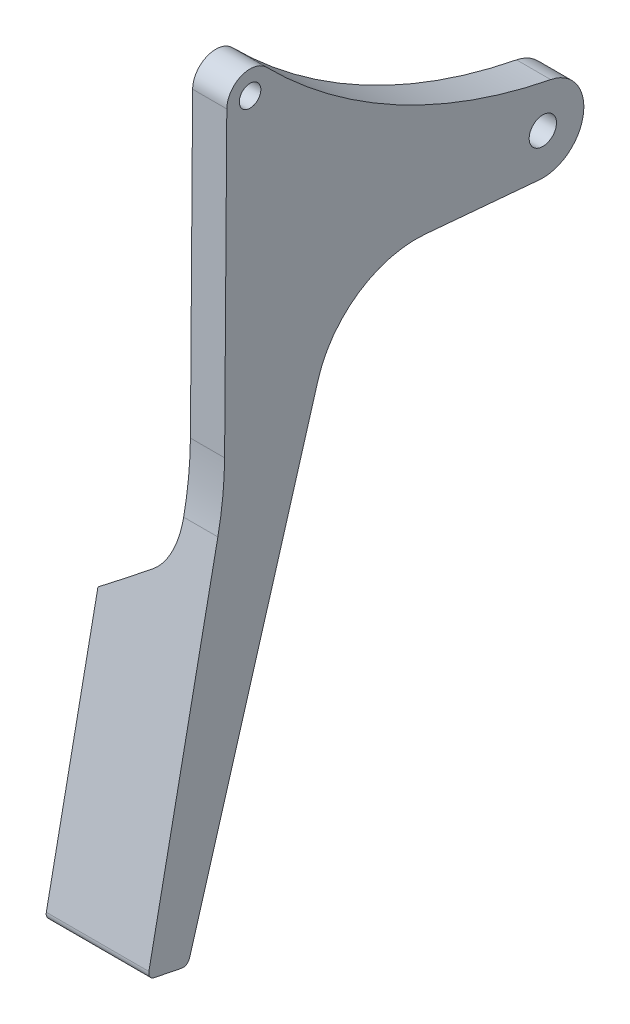
ISO-10303-21;
HEADER;
FILE_DESCRIPTION(('STEP AP214'),'2;1');
FILE_NAME('part.step','',(''),(''),'','','');
FILE_SCHEMA(('AUTOMOTIVE_DESIGN { 1 0 10303 214 1 1 1 1 }'));
ENDSEC;
DATA;
#1=APPLICATION_CONTEXT('core data for automotive mechanical design processes');
#2=APPLICATION_PROTOCOL_DEFINITION('international standard','automotive_design',2000,#1);
#3=PRODUCT_CONTEXT('',#1,'mechanical');
#4=PRODUCT('Part','Part','',(#3));
#5=PRODUCT_RELATED_PRODUCT_CATEGORY('part','',(#4));
#6=PRODUCT_DEFINITION_FORMATION('','',#4);
#7=PRODUCT_DEFINITION_CONTEXT('part definition',#1,'design');
#8=PRODUCT_DEFINITION('design','',#6,#7);
#9=PRODUCT_DEFINITION_SHAPE('','',#8);
#10=(LENGTH_UNIT() NAMED_UNIT(*) SI_UNIT(.MILLI.,.METRE.));
#11=(NAMED_UNIT(*) PLANE_ANGLE_UNIT() SI_UNIT($,.RADIAN.));
#12=(NAMED_UNIT(*) SI_UNIT($,.STERADIAN.) SOLID_ANGLE_UNIT());
#13=UNCERTAINTY_MEASURE_WITH_UNIT(LENGTH_MEASURE(1.E-05),#10,'distance_accuracy_value','');
#14=(GEOMETRIC_REPRESENTATION_CONTEXT(3) GLOBAL_UNCERTAINTY_ASSIGNED_CONTEXT((#13)) GLOBAL_UNIT_ASSIGNED_CONTEXT((#10,
#11,#12)) REPRESENTATION_CONTEXT('',''));
#15=CARTESIAN_POINT('',(0.,0.,0.));
#16=DIRECTION('',(0.,0.,1.));
#17=DIRECTION('',(1.,0.,0.));
#18=AXIS2_PLACEMENT_3D('',#15,#16,#17);
#19=CARTESIAN_POINT('',(151.369073395883,-130.610835145062,-36.0760840858191));
#20=DIRECTION('',(0.,0.282459573012156,0.959279203159222));
#21=DIRECTION('',(0.,-0.959279203159222,0.282459573012156));
#22=AXIS2_PLACEMENT_3D('',#19,#20,#21);
#23=PLANE('',#22);
#24=DIRECTION('',(0.,0.959279203159222,-0.282459573012156));
#25=VECTOR('',#24,1.);
#26=CARTESIAN_POINT('',(20.,-130.610835145062,-36.0760840858191));
#27=LINE('',#26,#25);
#28=CARTESIAN_POINT('',(20.,-129.73181770662,-36.3349105979698));
#29=VERTEX_POINT('',#28);
#30=CARTESIAN_POINT('',(20.,-65.9772299078886,-55.1074364568534));
#31=VERTEX_POINT('',#30);
#32=EDGE_CURVE('E269',#29,#31,#27,.T.);
#33=ORIENTED_EDGE('',*,*,#32,.F.);
#34=DIRECTION('',(-1.,0.,0.));
#35=VECTOR('',#34,1.);
#36=CARTESIAN_POINT('',(151.369073395883,-129.73181770662,-36.3349105979698));
#37=LINE('',#36,#35);
#38=CARTESIAN_POINT('',(5.,-129.73181770662,-36.3349105979698));
#39=VERTEX_POINT('',#38);
#40=EDGE_CURVE('E255',#29,#39,#37,.T.);
#41=ORIENTED_EDGE('',*,*,#40,.T.);
#42=DIRECTION('',(0.,-0.959279203159222,0.282459573012156));
#43=VECTOR('',#42,1.);
#44=CARTESIAN_POINT('',(5.,-130.610835145062,-36.0760840858191));
#45=LINE('',#44,#43);
#46=CARTESIAN_POINT('',(5.,-98.8626767975805,-45.4243230773648));
#47=VERTEX_POINT('',#46);
#48=EDGE_CURVE('E151',#47,#39,#45,.T.);
#49=ORIENTED_EDGE('',*,*,#48,.F.);
#50=CARTESIAN_POINT('',(12.0002,-94.5491696616821,-46.6944344065567));
#51=CARTESIAN_POINT('',(11.4182028055664,-94.9106805010551,-46.5879876108874));
#52=CARTESIAN_POINT('',(10.8358356044949,-95.2716429326272,-46.4817022937873));
#53=CARTESIAN_POINT('',(9.67040467771939,-95.9925278385912,-46.2694378747747));
#54=CARTESIAN_POINT('',(9.0873409541711,-96.35245031619,-46.1634587719178));
#55=CARTESIAN_POINT('',(7.92055704535733,-97.0713143003521,-45.951789412933));
#56=CARTESIAN_POINT('',(7.33683686028112,-97.4302558071981,-45.8460991567217));
#57=CARTESIAN_POINT('',(6.16877493214137,-98.1472108130644,-45.6349918960211));
#58=CARTESIAN_POINT('',(5.58443318716477,-98.5052243092168,-45.5295748923764));
#59=CARTESIAN_POINT('',(4.9998,-98.8627991217962,-45.4242870590235));
#60=B_SPLINE_CURVE_WITH_KNOTS('',3,(#50,#51,#52,#53,#54,#55,#56,#57,#58,#59),.UNSPECIFIED.,.F.,
.F.,(4,2,2,2,4),(0.,2.08006572174797,4.16012502211868,6.24018372293015,8.32024884449996),.UNSPECIFIED.);
#61=CARTESIAN_POINT('',(12.,-94.5492938931741,-46.6943978266183));
#62=VERTEX_POINT('',#61);
#63=EDGE_CURVE('E147',#62,#47,#60,.T.);
#64=ORIENTED_EDGE('',*,*,#63,.F.);
#65=CARTESIAN_POINT('',(10.2121982477967,-82.2674565731797,-50.3107824139057));
#66=CARTESIAN_POINT('',(10.3560917340139,-82.3016566687612,-50.3007122024771));
#67=CARTESIAN_POINT('',(10.4983986155981,-82.3418682436262,-50.2888719121538));
#68=CARTESIAN_POINT('',(10.778975423692,-82.4336444368812,-50.2618484300705));
#69=CARTESIAN_POINT('',(10.9172455330938,-82.4852085400207,-50.2466653900258));
#70=CARTESIAN_POINT('',(11.1877852789521,-82.5985567909452,-50.2132900197975));
#71=CARTESIAN_POINT('',(11.3200948002996,-82.6602537315205,-50.1951233677595));
#72=CARTESIAN_POINT('',(11.5792001734314,-82.7934016345987,-50.1559179938422));
#73=CARTESIAN_POINT('',(11.7059985995433,-82.8648479769961,-50.1348806323521));
#74=CARTESIAN_POINT('',(11.8870938347137,-82.9759483103893,-50.1021671609994));
#75=CARTESIAN_POINT('',(11.9437765877548,-83.0120841020354,-50.0915269842446));
#76=CARTESIAN_POINT('',(12.1539714965371,-83.1511658682102,-50.0505743855036));
#77=CARTESIAN_POINT('',(12.3031497925194,-83.2602495932803,-50.0184547040757));
#78=CARTESIAN_POINT('',(12.5906738629697,-83.4909705280735,-49.9505189701288));
#79=CARTESIAN_POINT('',(12.7290101704691,-83.6126184984615,-49.9146997491341));
#80=CARTESIAN_POINT('',(12.9946163376098,-83.8673195300084,-49.8397030804066));
#81=CARTESIAN_POINT('',(13.1218508168115,-84.0004065500636,-49.8005156334835));
#82=CARTESIAN_POINT('',(13.3643141868718,-84.276168062179,-49.7193177103879));
#83=CARTESIAN_POINT('',(13.4795456314004,-84.4188405042524,-49.6773078378337));
#84=CARTESIAN_POINT('',(13.8053262009693,-84.8572926506972,-49.5482056894047));
#85=CARTESIAN_POINT('',(13.9980167614536,-85.1655110531775,-49.4574508413143));
#86=CARTESIAN_POINT('',(14.3335131201671,-85.8053493758062,-49.269050572851));
#87=CARTESIAN_POINT('',(14.4763528607843,-86.1369531876685,-49.1714098955597));
#88=CARTESIAN_POINT('',(14.7265918706339,-86.8594748071178,-48.9586635465827));
#89=CARTESIAN_POINT('',(14.8271757562416,-87.2525733725126,-48.8429157511886));
#90=CARTESIAN_POINT('',(14.9629716770305,-88.0494074376766,-48.6082881171624));
#91=CARTESIAN_POINT('',(14.9981391351478,-88.4531500007737,-48.4894061987348));
#92=CARTESIAN_POINT('',(15.0008837688096,-89.0721001941548,-48.307156435827));
#93=CARTESIAN_POINT('',(14.9923315878284,-89.2874338627123,-48.2437514794018));
#94=CARTESIAN_POINT('',(14.9560481027994,-89.716585677898,-48.1173878116859));
#95=CARTESIAN_POINT('',(14.9283239783676,-89.9304043615947,-48.0544289422556));
#96=CARTESIAN_POINT('',(14.8535094321724,-90.3550580449837,-47.929389748564));
#97=CARTESIAN_POINT('',(14.8064050738572,-90.5658907843553,-47.8673100898538));
#98=CARTESIAN_POINT('',(14.6927517057689,-90.9825847816574,-47.7446146241677));
#99=CARTESIAN_POINT('',(14.6262125568911,-91.1884485035789,-47.68399809167));
#100=CARTESIAN_POINT('',(14.4761823834504,-91.5867682373191,-47.5667129242818));
#101=CARTESIAN_POINT('',(14.3933220072432,-91.7794425275898,-47.5099800173439));
#102=CARTESIAN_POINT('',(14.2095519314336,-92.1565983463719,-47.3989265605595));
#103=CARTESIAN_POINT('',(14.1086518523973,-92.3410841766438,-47.3446047440604));
#104=CARTESIAN_POINT('',(13.889158674031,-92.6998583204088,-47.2389637678754));
#105=CARTESIAN_POINT('',(13.7705852426386,-92.8741576735895,-47.1876413575557));
#106=CARTESIAN_POINT('',(13.5162186546305,-93.2106655935601,-47.0885566665949));
#107=CARTESIAN_POINT('',(13.3804336900984,-93.3728798544878,-47.0407927093161));
#108=CARTESIAN_POINT('',(13.0547997964572,-93.7236419588947,-46.937510876547));
#109=CARTESIAN_POINT('',(12.8600760781423,-93.9080611167038,-46.8832086917415));
#110=CARTESIAN_POINT('',(12.4468594578344,-94.2499210788239,-46.7825480930208));
#111=CARTESIAN_POINT('',(12.2284157256078,-94.4074160129767,-46.7361737405842));
#112=CARTESIAN_POINT('',(11.9395241702623,-94.5868577779141,-46.6833371481325));
#113=CARTESIAN_POINT('',(11.8785412414608,-94.6232204635487,-46.6726301624873));
#114=CARTESIAN_POINT('',(11.7552371521769,-94.6937256281903,-46.6518699306025));
#115=CARTESIAN_POINT('',(11.6929166662377,-94.7278691928792,-46.641816364684));
#116=CARTESIAN_POINT('',(11.6299352877812,-94.7608880290739,-46.6320939748499));
#117=B_SPLINE_CURVE_WITH_KNOTS('',3,(#65,#66,#67,#68,#69,#70,#71,#72,#73,#74,#75,#76,#77,#78,
#79,#80,#81,#82,#83,#84,#85,#86,#87,#88,#89,#90,#91,#92,#93,#94,#95,#96,#97,#98,#99,#100,#101,
#102,#103,#104,#105,#106,#107,#108,#109,#110,#111,#112,#113,#114,#115,#116),.UNSPECIFIED.,.F.,
.F.,(4,2,2,2,2,2,2,2,2,2,2,2,2,2,2,2,2,2,2,2,2,2,2,2,2,4),(0.,0.444547442939623,
0.889074713616478,1.32995944485223,1.77063596787653,1.97478905799571,2.53660038231523,
3.0988969246382,3.66292456028439,4.22683195176099,5.34595702641683,6.464318618592,
7.72487708373967,8.98629422371091,9.65951417437289,10.3324821503186,11.0059349135674,
11.6790465697058,12.3299841708506,12.9805756571401,13.630448459586,14.2800130988454,
15.0985734644715,15.9154682902784,16.1308472337098,16.3461199994622),.UNSPECIFIED.);
#118=CARTESIAN_POINT('',(15.,-88.8890276590472,-48.3610621078424));
#119=VERTEX_POINT('',#118);
#120=EDGE_CURVE('E138',#119,#62,#117,.T.);
#121=ORIENTED_EDGE('',*,*,#120,.F.);
#122=DIRECTION('',(0.,-0.959279203159222,0.282459573012156));
#123=VECTOR('',#122,1.);
#124=CARTESIAN_POINT('',(15.,-54.1954640943712,-58.5765750872496));
#125=LINE('',#124,#123);
#126=CARTESIAN_POINT('',(15.,-65.9772299078886,-55.1074364568534));
#127=VERTEX_POINT('',#126);
#128=EDGE_CURVE('E122',#127,#119,#125,.T.);
#129=ORIENTED_EDGE('',*,*,#128,.F.);
#130=DIRECTION('',(-1.,0.,0.));
#131=VECTOR('',#130,1.);
#132=CARTESIAN_POINT('',(20.,-65.9772299078886,-55.1074364568534));
#133=LINE('',#132,#131);
#134=EDGE_CURVE('E250',#127,#31,#133,.F.);
#135=ORIENTED_EDGE('',*,*,#134,.T.);
#136=EDGE_LOOP('',(#33,#41,#49,#64,#121,#129,#135));
#137=FACE_BOUND('',#136,.T.);
#138=ADVANCED_FACE('F17',(#137),#23,.F.);
#139=CARTESIAN_POINT('',(151.369073395883,-129.424166919424,-30.1946031054654));
#140=DIRECTION('',(0.,0.980246830058951,-0.197778037606247));
#141=DIRECTION('',(0.,0.197778037606247,0.980246830058951));
#142=AXIS2_PLACEMENT_3D('',#139,#140,#141);
#143=PLANE('',#142);
#144=DIRECTION('',(0.,0.197778037606247,0.980246830058951));
#145=VECTOR('',#144,1.);
#146=CARTESIAN_POINT('',(5.,-129.424166919424,-30.1946031054654));
#147=LINE('',#146,#145);
#148=CARTESIAN_POINT('',(5.,-130.429604963667,-35.1778533572043));
#149=VERTEX_POINT('',#148);
#150=CARTESIAN_POINT('',(5.,-129.621944957031,-31.1748499355243));
#151=VERTEX_POINT('',#150);
#152=EDGE_CURVE('E148',#149,#151,#147,.T.);
#153=ORIENTED_EDGE('',*,*,#152,.F.);
#154=DIRECTION('',(-1.,0.,0.));
#155=VECTOR('',#154,1.);
#156=CARTESIAN_POINT('',(151.369073395883,-130.429604963667,-35.1778533572043));
#157=LINE('',#156,#155);
#158=CARTESIAN_POINT('',(20.,-130.429604963667,-35.1778533572043));
#159=VERTEX_POINT('',#158);
#160=EDGE_CURVE('E38',#149,#159,#157,.F.);
#161=ORIENTED_EDGE('',*,*,#160,.T.);
#162=DIRECTION('',(0.,-0.197778037606247,-0.980246830058951));
#163=VECTOR('',#162,1.);
#164=CARTESIAN_POINT('',(20.,-129.424166919424,-30.1946031054654));
#165=LINE('',#164,#163);
#166=CARTESIAN_POINT('',(20.,-129.621944957031,-31.1748499355243));
#167=VERTEX_POINT('',#166);
#168=EDGE_CURVE('E270',#167,#159,#165,.T.);
#169=ORIENTED_EDGE('',*,*,#168,.F.);
#170=DIRECTION('',(-1.,0.,0.));
#171=VECTOR('',#170,1.);
#172=CARTESIAN_POINT('',(151.369073395883,-129.621944957031,-31.1748499355243));
#173=LINE('',#172,#171);
#174=EDGE_CURVE('E262',#167,#151,#173,.T.);
#175=ORIENTED_EDGE('',*,*,#174,.T.);
#176=EDGE_LOOP('',(#153,#161,#169,#175));
#177=FACE_BOUND('',#176,.T.);
#178=ADVANCED_FACE('F225',(#177),#143,.F.);
#179=CARTESIAN_POINT('',(151.369073395883,-78.4513317563589,-40.4790610609904));
#180=DIRECTION('',(0.,-0.197778037606251,-0.98024683005895));
#181=DIRECTION('',(0.,0.98024683005895,-0.197778037606251));
#182=AXIS2_PLACEMENT_3D('',#179,#180,#181);
#183=PLANE('',#182);
#184=DIRECTION('',(0.,0.98024683005895,-0.197778037606251));
#185=VECTOR('',#184,1.);
#186=CARTESIAN_POINT('',(5.,-78.451331756359,-40.4790610609904));
#187=LINE('',#186,#185);
#188=CARTESIAN_POINT('',(5.,-128.443920089365,-30.3923811430717));
#189=VERTEX_POINT('',#188);
#190=CARTESIAN_POINT('',(5.,-91.0198727254016,-37.9431881642818));
#191=VERTEX_POINT('',#190);
#192=EDGE_CURVE('E246',#189,#191,#187,.T.);
#193=ORIENTED_EDGE('',*,*,#192,.F.);
#194=DIRECTION('',(-1.,0.,0.));
#195=VECTOR('',#194,1.);
#196=CARTESIAN_POINT('',(151.369073395883,-128.443920089365,-30.3923811430717));
#197=LINE('',#196,#195);
#198=CARTESIAN_POINT('',(20.,-128.443920089365,-30.3923811430717));
#199=VERTEX_POINT('',#198);
#200=EDGE_CURVE('E11',#189,#199,#197,.F.);
#201=ORIENTED_EDGE('',*,*,#200,.T.);
#202=DIRECTION('',(0.,-0.98024683005895,0.197778037606251));
#203=VECTOR('',#202,1.);
#204=CARTESIAN_POINT('',(20.,-78.4513317563589,-40.4790610609904));
#205=LINE('',#204,#203);
#206=CARTESIAN_POINT('',(20.,-78.4513317563589,-40.4790610609904));
#207=VERTEX_POINT('',#206);
#208=EDGE_CURVE('E334',#207,#199,#205,.T.);
#209=ORIENTED_EDGE('',*,*,#208,.F.);
#210=DIRECTION('',(-1.,0.,0.));
#211=VECTOR('',#210,1.);
#212=CARTESIAN_POINT('',(151.369073395883,-78.4513317563589,-40.4790610609904));
#213=LINE('',#212,#211);
#214=CARTESIAN_POINT('',(15.,-78.4513317563589,-40.4790610609904));
#215=VERTEX_POINT('',#214);
#216=EDGE_CURVE('E285',#207,#215,#213,.T.);
#217=ORIENTED_EDGE('',*,*,#216,.T.);
#218=CARTESIAN_POINT('',(10.0417159803187,-86.6900360485243,-38.8167911945072));
#219=CARTESIAN_POINT('',(10.170046103958,-86.6600082082887,-38.8228497168439));
#220=CARTESIAN_POINT('',(10.2970072382492,-86.6245121766769,-38.8300115206465));
#221=CARTESIAN_POINT('',(10.5474145463663,-86.5432487110049,-38.8464075224257));
#222=CARTESIAN_POINT('',(10.6708620127869,-86.4974851106428,-38.8556409469019));
#223=CARTESIAN_POINT('',(10.9128300879888,-86.3966330931319,-38.8759892035861));
#224=CARTESIAN_POINT('',(11.0313759152587,-86.3416025634574,-38.8870923562143));
#225=CARTESIAN_POINT('',(11.2637581151421,-86.2227683616672,-38.9110687614522));
#226=CARTESIAN_POINT('',(11.377595543906,-86.1589666710646,-38.9239416142648));
#227=CARTESIAN_POINT('',(11.5773393793949,-86.0372446819524,-38.9485006695985));
#228=CARTESIAN_POINT('',(11.6641875919581,-85.9808000027738,-38.9598891459892));
#229=CARTESIAN_POINT('',(11.8345367317572,-85.8631958434393,-38.9836173735481));
#230=CARTESIAN_POINT('',(11.9180362919313,-85.8020344669195,-38.9959575073333));
#231=CARTESIAN_POINT('',(12.1557324200257,-85.6179074190579,-39.0331076261397));
#232=CARTESIAN_POINT('',(12.305351424135,-85.4892050248343,-39.059075072485));
#233=CARTESIAN_POINT('',(12.5915167118914,-85.218409234047,-39.1137117807626));
#234=CARTESIAN_POINT('',(12.7280512026828,-85.0763039823436,-39.1423834346294));
#235=CARTESIAN_POINT('',(12.9883889460264,-84.7803913873493,-39.2020877973942));
#236=CARTESIAN_POINT('',(13.1121428612832,-84.626542410911,-39.2331289063421));
#237=CARTESIAN_POINT('',(13.3464752085818,-84.3096290938393,-39.297070448431));
#238=CARTESIAN_POINT('',(13.4570553777866,-84.1465659724242,-39.3299706355783));
#239=CARTESIAN_POINT('',(13.8304804646799,-83.5484732065445,-39.4506439291966));
#240=CARTESIAN_POINT('',(14.0574334783401,-83.0913230201391,-39.542880153774));
#241=CARTESIAN_POINT('',(14.3394340869497,-82.3847826584351,-39.6854342145906));
#242=CARTESIAN_POINT('',(14.423721059011,-82.1456870026754,-39.7336749924704));
#243=CARTESIAN_POINT('',(14.5740528483304,-81.6620028398061,-39.8312648051789));
#244=CARTESIAN_POINT('',(14.6401001104618,-81.4174150736229,-39.8806136905156));
#245=CARTESIAN_POINT('',(14.8012078537749,-80.7254581498734,-40.0202253457545));
#246=CARTESIAN_POINT('',(14.8766983342104,-80.2736588527861,-40.1113819561405));
#247=CARTESIAN_POINT('',(14.9760995430361,-79.3649072165469,-40.2947348727483));
#248=CARTESIAN_POINT('',(15.000012110766,-78.9079550617372,-40.3869311417766));
#249=CARTESIAN_POINT('',(14.9999915548011,-78.1326732474489,-40.5433547191041));
#250=CARTESIAN_POINT('',(14.9883564410521,-77.8142773554612,-40.6075953907066));
#251=CARTESIAN_POINT('',(14.9427034970164,-77.1789487972657,-40.7357815083475));
#252=CARTESIAN_POINT('',(14.9086803414483,-76.8620164972581,-40.7997268805001));
#253=CARTESIAN_POINT('',(14.8188593123569,-76.2314197229474,-40.9269582968328));
#254=CARTESIAN_POINT('',(14.7630819930231,-75.9177524500931,-40.9902449056583));
#255=CARTESIAN_POINT('',(14.6632773029568,-75.4506793531712,-41.0844832114556));
#256=CARTESIAN_POINT('',(14.6273249784219,-75.2955794530623,-41.1157767111496));
#257=CARTESIAN_POINT('',(14.550018922305,-74.9866755414261,-41.1781022475133));
#258=CARTESIAN_POINT('',(14.5086650804228,-74.83287155643,-41.2091342788301));
#259=CARTESIAN_POINT('',(14.4646003373915,-74.679802343249,-41.240018060009));
#260=B_SPLINE_CURVE_WITH_KNOTS('',3,(#218,#219,#220,#221,#222,#223,#224,#225,#226,#227,#228,
#229,#230,#231,#232,#233,#234,#235,#236,#237,#238,#239,#240,#241,#242,#243,#244,#245,#246,#247,
#248,#249,#250,#251,#252,#253,#254,#255,#256,#257,#258,#259),.UNSPECIFIED.,.F.,.F.,(4,2,2,2,2,2,
2,2,2,2,2,2,2,2,2,2,2,2,2,2,4),(0.,0.395630598819087,0.791113722456629,1.18421229013661,
1.57722219750201,1.88966432451393,2.202232731478,2.79833519885327,3.39496996798682,
3.99382802318967,4.59260702203632,6.13872436557128,6.91248430763877,7.68614048357268,
9.08384249221617,10.4814946560455,11.4558193431349,12.4303758695956,13.4040138187486,
13.890706968409,14.3774100580114),.UNSPECIFIED.);
#261=CARTESIAN_POINT('',(12.,-85.7385427445483,-39.0087678198686));
#262=VERTEX_POINT('',#261);
#263=EDGE_CURVE('E141',#262,#215,#260,.T.);
#264=ORIENTED_EDGE('',*,*,#263,.F.);
#265=CARTESIAN_POINT('',(4.9998,-91.0200200192602,-37.9431584457565));
#266=CARTESIAN_POINT('',(5.58837369639777,-90.5865481831294,-38.0306172433558));
#267=CARTESIAN_POINT('',(6.17578582321182,-90.1515580777146,-38.1183823722896));
#268=CARTESIAN_POINT('',(7.34806303944173,-89.2783371618525,-38.2945664861679));
#269=CARTESIAN_POINT('',(7.93292822289283,-88.84010647269,-38.3829854466415));
#270=CARTESIAN_POINT('',(9.09993371838689,-87.9601663140096,-38.5605252585114));
#271=CARTESIAN_POINT('',(9.68207402015717,-87.5184568313936,-38.6496461125504));
#272=CARTESIAN_POINT('',(10.843410423823,-86.6312914262308,-38.8286437154855));
#273=CARTESIAN_POINT('',(11.4226064152472,-86.1858353647516,-38.9185204924131));
#274=CARTESIAN_POINT('',(12.0002,-85.7383878068825,-39.0087990806353));
#275=B_SPLINE_CURVE_WITH_KNOTS('',3,(#265,#266,#267,#268,#269,#270,#271,#272,#273,#274),
.UNSPECIFIED.,.F.,.F.,(4,2,2,2,4),(0.,2.20854982588796,4.41701740697654,6.62549330719743,
8.83405146736048),.UNSPECIFIED.);
#276=EDGE_CURVE('E238',#191,#262,#275,.T.);
#277=ORIENTED_EDGE('',*,*,#276,.F.);
#278=EDGE_LOOP('',(#193,#201,#209,#217,#264,#277));
#279=FACE_BOUND('',#278,.T.);
#280=ADVANCED_FACE('F201',(#279),#183,.F.);
#281=CARTESIAN_POINT('',(151.369073395883,-68.9283945476644,-41.4653802386964));
#282=DIRECTION('',(0.,-0.00731929343236015,-0.99997321361307));
#283=DIRECTION('',(0.,0.99997321361307,-0.00731929343236015));
#284=AXIS2_PLACEMENT_3D('',#281,#282,#283);
#285=PLANE('',#284);
#286=DIRECTION('',(-1.,0.,0.));
#287=VECTOR('',#286,1.);
#288=CARTESIAN_POINT('',(151.369073395883,-24.9079314224505,-41.7875875561082));
#289=LINE('',#288,#287);
#290=CARTESIAN_POINT('',(20.,-24.9079314224505,-41.7875875561082));
#291=VERTEX_POINT('',#290);
#292=CARTESIAN_POINT('',(15.,-24.9079314224505,-41.7875875561082));
#293=VERTEX_POINT('',#292);
#294=EDGE_CURVE('E342',#291,#293,#289,.T.);
#295=ORIENTED_EDGE('',*,*,#294,.T.);
#296=DIRECTION('',(0.,0.99997321361307,-0.00731929343236031));
#297=VECTOR('',#296,1.);
#298=CARTESIAN_POINT('',(15.,-68.9283945476644,-41.4653802386964));
#299=LINE('',#298,#297);
#300=CARTESIAN_POINT('',(15.,-68.9283945476644,-41.4653802386964));
#301=VERTEX_POINT('',#300);
#302=EDGE_CURVE('E308',#301,#293,#299,.T.);
#303=ORIENTED_EDGE('',*,*,#302,.F.);
#304=DIRECTION('',(-1.,0.,0.));
#305=VECTOR('',#304,1.);
#306=CARTESIAN_POINT('',(151.369073395883,-68.9283945476644,-41.4653802386964));
#307=LINE('',#306,#305);
#308=CARTESIAN_POINT('',(20.,-68.9283945476644,-41.4653802386964));
#309=VERTEX_POINT('',#308);
#310=EDGE_CURVE('E339',#309,#301,#307,.T.);
#311=ORIENTED_EDGE('',*,*,#310,.F.);
#312=DIRECTION('',(0.,-0.99997321361307,0.00731929343236015));
#313=VECTOR('',#312,1.);
#314=CARTESIAN_POINT('',(20.,-68.9283945476644,-41.4653802386964));
#315=LINE('',#314,#313);
#316=EDGE_CURVE('E320',#291,#309,#315,.T.);
#317=ORIENTED_EDGE('',*,*,#316,.F.);
#318=EDGE_LOOP('',(#295,#303,#311,#317));
#319=FACE_BOUND('',#318,.T.);
#320=ADVANCED_FACE('F197',(#319),#285,.F.);
#321=CARTESIAN_POINT('',(151.369073395883,-24.9328170201205,-45.1874964823926));
#322=DIRECTION('',(-1.,0.,0.));
#323=DIRECTION('',(0.,0.,1.));
#324=AXIS2_PLACEMENT_3D('',#321,#322,#323);
#325=CYLINDRICAL_SURFACE('',#324,3.4);
#326=DIRECTION('',(-1.,0.,0.));
#327=VECTOR('',#326,1.);
#328=CARTESIAN_POINT('',(151.369073395883,-22.5454530343527,-47.6083420370406));
#329=LINE('',#328,#327);
#330=CARTESIAN_POINT('',(20.,-22.5454530343527,-47.6083420370406));
#331=VERTEX_POINT('',#330);
#332=CARTESIAN_POINT('',(15.,-22.5454530343528,-47.6083420370406));
#333=VERTEX_POINT('',#332);
#334=EDGE_CURVE('E345',#331,#333,#329,.T.);
#335=ORIENTED_EDGE('',*,*,#334,.T.);
#336=CARTESIAN_POINT('',(15.,-24.9328170201205,-45.1874964823926));
#337=DIRECTION('',(1.,0.,0.));
#338=DIRECTION('',(0.,0.,-1.));
#339=AXIS2_PLACEMENT_3D('',#336,#337,#338);
#340=CIRCLE('',#339,3.4);
#341=EDGE_CURVE('E316',#293,#333,#340,.F.);
#342=ORIENTED_EDGE('',*,*,#341,.F.);
#343=ORIENTED_EDGE('',*,*,#294,.F.);
#344=CARTESIAN_POINT('',(20.,-24.9328170201205,-45.1874964823926));
#345=DIRECTION('',(1.,0.,0.));
#346=DIRECTION('',(0.,0.,-1.));
#347=AXIS2_PLACEMENT_3D('',#344,#345,#346);
#348=CIRCLE('',#347,3.4);
#349=EDGE_CURVE('E323',#331,#291,#348,.T.);
#350=ORIENTED_EDGE('',*,*,#349,.F.);
#351=EDGE_LOOP('',(#335,#342,#343,#350));
#352=FACE_BOUND('',#351,.T.);
#353=ADVANCED_FACE('F200',(#352),#325,.T.);
#354=CARTESIAN_POINT('',(151.369073395883,33.6278172190068,-104.569413911111));
#355=DIRECTION('',(-1.,0.,0.));
#356=DIRECTION('',(0.,0.,1.));
#357=AXIS2_PLACEMENT_3D('',#354,#355,#356);
#358=CYLINDRICAL_SURFACE('',#357,80.);
#359=DIRECTION('',(-1.,0.,0.));
#360=VECTOR('',#359,1.);
#361=CARTESIAN_POINT('',(151.369073395883,-44.8733091735749,-89.1560056217054));
#362=LINE('',#361,#360);
#363=CARTESIAN_POINT('',(20.,-44.8733091735749,-89.1560056217054));
#364=VERTEX_POINT('',#363);
#365=CARTESIAN_POINT('',(15.,-44.8733091735749,-89.1560056217055));
#366=VERTEX_POINT('',#365);
#367=EDGE_CURVE('E291',#364,#366,#362,.T.);
#368=ORIENTED_EDGE('',*,*,#367,.T.);
#369=CARTESIAN_POINT('',(15.,33.6278172190068,-104.569413911111));
#370=DIRECTION('',(1.,0.,0.));
#371=DIRECTION('',(0.,0.,-1.));
#372=AXIS2_PLACEMENT_3D('',#369,#370,#371);
#373=CIRCLE('',#372,80.);
#374=EDGE_CURVE('E314',#333,#366,#373,.T.);
#375=ORIENTED_EDGE('',*,*,#374,.F.);
#376=ORIENTED_EDGE('',*,*,#334,.F.);
#377=CARTESIAN_POINT('',(20.,33.6278172190068,-104.569413911111));
#378=DIRECTION('',(1.,0.,0.));
#379=DIRECTION('',(0.,0.,-1.));
#380=AXIS2_PLACEMENT_3D('',#377,#378,#379);
#381=CIRCLE('',#380,80.);
#382=EDGE_CURVE('E326',#364,#331,#381,.F.);
#383=ORIENTED_EDGE('',*,*,#382,.F.);
#384=EDGE_LOOP('',(#368,#375,#376,#383));
#385=FACE_BOUND('',#384,.T.);
#386=ADVANCED_FACE('F205',(#385),#358,.F.);
#387=CARTESIAN_POINT('',(151.369073395883,-50.7608936530185,-88.));
#388=DIRECTION('',(-1.,0.,0.));
#389=DIRECTION('',(0.,0.,1.));
#390=AXIS2_PLACEMENT_3D('',#387,#388,#389);
#391=CYLINDRICAL_SURFACE('',#390,6.);
#392=DIRECTION('',(-1.,0.,0.));
#393=VECTOR('',#392,1.);
#394=CARTESIAN_POINT('',(151.369073395883,-56.7378073610981,-87.4741649249334));
#395=LINE('',#394,#393);
#396=CARTESIAN_POINT('',(20.,-56.7378073610981,-87.4741649249334));
#397=VERTEX_POINT('',#396);
#398=CARTESIAN_POINT('',(15.,-56.7378073610981,-87.4741649249334));
#399=VERTEX_POINT('',#398);
#400=EDGE_CURVE('E287',#397,#399,#395,.T.);
#401=ORIENTED_EDGE('',*,*,#400,.T.);
#402=CARTESIAN_POINT('',(15.,-50.7608936530185,-88.));
#403=DIRECTION('',(1.,0.,0.));
#404=DIRECTION('',(0.,0.,-1.));
#405=AXIS2_PLACEMENT_3D('',#402,#403,#404);
#406=CIRCLE('',#405,6.);
#407=EDGE_CURVE('E312',#366,#399,#406,.F.);
#408=ORIENTED_EDGE('',*,*,#407,.F.);
#409=ORIENTED_EDGE('',*,*,#367,.F.);
#410=CARTESIAN_POINT('',(20.,-50.7608936530185,-88.));
#411=DIRECTION('',(1.,0.,0.));
#412=DIRECTION('',(0.,0.,-1.));
#413=AXIS2_PLACEMENT_3D('',#410,#411,#412);
#414=CIRCLE('',#413,6.);
#415=EDGE_CURVE('E329',#397,#364,#414,.T.);
#416=ORIENTED_EDGE('',*,*,#415,.F.);
#417=EDGE_LOOP('',(#401,#408,#409,#416));
#418=FACE_BOUND('',#417,.T.);
#419=ADVANCED_FACE('F209',(#418),#391,.T.);
#420=CARTESIAN_POINT('',(151.369073395883,-56.7378073610981,-87.4741649249334));
#421=DIRECTION('',(0.,0.996152284679931,-0.0876391791777764));
#422=DIRECTION('',(0.,0.0876391791777764,0.996152284679931));
#423=AXIS2_PLACEMENT_3D('',#420,#421,#422);
#424=PLANE('',#423);
#425=DIRECTION('',(0.,-0.0876391791777764,-0.996152284679931));
#426=VECTOR('',#425,1.);
#427=CARTESIAN_POINT('',(20.,-56.7378073610981,-87.4741649249334));
#428=LINE('',#427,#426);
#429=CARTESIAN_POINT('',(20.,-55.271839232872,-70.8112121919084));
#430=VERTEX_POINT('',#429);
#431=EDGE_CURVE('E275',#430,#397,#428,.T.);
#432=ORIENTED_EDGE('',*,*,#431,.F.);
#433=DIRECTION('',(-1.,0.,0.));
#434=VECTOR('',#433,1.);
#435=CARTESIAN_POINT('',(15.,-55.271839232872,-70.8112121919084));
#436=LINE('',#435,#434);
#437=CARTESIAN_POINT('',(15.,-55.271839232872,-70.8112121919084));
#438=VERTEX_POINT('',#437);
#439=EDGE_CURVE('E245',#430,#438,#436,.T.);
#440=ORIENTED_EDGE('',*,*,#439,.T.);
#441=DIRECTION('',(0.,0.0876391791777765,0.996152284679931));
#442=VECTOR('',#441,1.);
#443=CARTESIAN_POINT('',(15.,-56.7378073610981,-87.4741649249334));
#444=LINE('',#443,#442);
#445=EDGE_CURVE('E133',#399,#438,#444,.T.);
#446=ORIENTED_EDGE('',*,*,#445,.F.);
#447=ORIENTED_EDGE('',*,*,#400,.F.);
#448=EDGE_LOOP('',(#432,#440,#446,#447));
#449=FACE_BOUND('',#448,.T.);
#450=ADVANCED_FACE('F212',(#449),#424,.F.);
#451=CARTESIAN_POINT('',(151.369073395883,-68.5624298760464,8.53328044195707));
#452=DIRECTION('',(-1.,0.,0.));
#453=DIRECTION('',(0.,0.,1.));
#454=AXIS2_PLACEMENT_3D('',#451,#452,#453);
#455=CYLINDRICAL_SURFACE('',#454,50.);
#456=ORIENTED_EDGE('',*,*,#310,.T.);
#457=CARTESIAN_POINT('',(15.,-68.5624298760464,8.53328044195707));
#458=DIRECTION('',(1.,0.,0.));
#459=DIRECTION('',(0.,0.,-1.));
#460=AXIS2_PLACEMENT_3D('',#457,#458,#459);
#461=CIRCLE('',#460,50.);
#462=EDGE_CURVE('E142',#215,#301,#461,.T.);
#463=ORIENTED_EDGE('',*,*,#462,.F.);
#464=ORIENTED_EDGE('',*,*,#216,.F.);
#465=CARTESIAN_POINT('',(20.,-68.5624298760464,8.53328044195707));
#466=DIRECTION('',(1.,0.,0.));
#467=DIRECTION('',(0.,0.,-1.));
#468=AXIS2_PLACEMENT_3D('',#465,#466,#467);
#469=CIRCLE('',#468,50.);
#470=EDGE_CURVE('E336',#309,#207,#469,.F.);
#471=ORIENTED_EDGE('',*,*,#470,.F.);
#472=EDGE_LOOP('',(#456,#463,#464,#471));
#473=FACE_BOUND('',#472,.T.);
#474=ADVANCED_FACE('F195',(#473),#455,.F.);
#475=CARTESIAN_POINT('',(151.369073395883,-24.9328170201205,-45.1874964823926));
#476=DIRECTION('',(-1.,0.,0.));
#477=DIRECTION('',(0.,0.,1.));
#478=AXIS2_PLACEMENT_3D('',#475,#476,#477);
#479=CYLINDRICAL_SURFACE('',#478,1.575);
#480=CARTESIAN_POINT('',(15.,-24.9328170201205,-45.1874964823926));
#481=DIRECTION('',(1.,0.,0.));
#482=DIRECTION('',(0.,0.,-1.));
#483=AXIS2_PLACEMENT_3D('',#480,#481,#482);
#484=CIRCLE('',#483,1.575);
#485=CARTESIAN_POINT('',(15.,-24.9328170201205,-46.7624964823926));
#486=VERTEX_POINT('',#485);
#487=EDGE_CURVE('E298',#486,#486,#484,.T.);
#488=ORIENTED_EDGE('',*,*,#487,.F.);
#489=EDGE_LOOP('',(#488));
#490=FACE_BOUND('',#489,.T.);
#491=CARTESIAN_POINT('',(20.,-24.9328170201205,-45.1874964823926));
#492=DIRECTION('',(1.,0.,0.));
#493=DIRECTION('',(0.,0.,-1.));
#494=AXIS2_PLACEMENT_3D('',#491,#492,#493);
#495=CIRCLE('',#494,1.575);
#496=CARTESIAN_POINT('',(20.,-24.9328170201205,-46.7624964823926));
#497=VERTEX_POINT('',#496);
#498=EDGE_CURVE('E297',#497,#497,#495,.T.);
#499=ORIENTED_EDGE('',*,*,#498,.T.);
#500=EDGE_LOOP('',(#499));
#501=FACE_BOUND('',#500,.T.);
#502=ADVANCED_FACE('F191',(#490,#501),#479,.F.);
#503=CARTESIAN_POINT('',(151.369073395883,-50.7608936530185,-88.));
#504=DIRECTION('',(-1.,0.,0.));
#505=DIRECTION('',(0.,0.,1.));
#506=AXIS2_PLACEMENT_3D('',#503,#504,#505);
#507=CYLINDRICAL_SURFACE('',#506,2.);
#508=CARTESIAN_POINT('',(15.,-50.7608936530185,-88.));
#509=DIRECTION('',(1.,0.,0.));
#510=DIRECTION('',(0.,0.,-1.));
#511=AXIS2_PLACEMENT_3D('',#508,#509,#510);
#512=CIRCLE('',#511,2.);
#513=CARTESIAN_POINT('',(15.,-50.7608936530185,-90.));
#514=VERTEX_POINT('',#513);
#515=EDGE_CURVE('E299',#514,#514,#512,.T.);
#516=ORIENTED_EDGE('',*,*,#515,.F.);
#517=EDGE_LOOP('',(#516));
#518=FACE_BOUND('',#517,.T.);
#519=CARTESIAN_POINT('',(20.,-50.7608936530185,-88.));
#520=DIRECTION('',(1.,0.,0.));
#521=DIRECTION('',(0.,0.,-1.));
#522=AXIS2_PLACEMENT_3D('',#519,#520,#521);
#523=CIRCLE('',#522,2.);
#524=CARTESIAN_POINT('',(20.,-50.7608936530185,-90.));
#525=VERTEX_POINT('',#524);
#526=EDGE_CURVE('E295',#525,#525,#523,.T.);
#527=ORIENTED_EDGE('',*,*,#526,.T.);
#528=EDGE_LOOP('',(#527));
#529=FACE_BOUND('',#528,.T.);
#530=ADVANCED_FACE('F187',(#518,#529),#507,.F.);
#531=CARTESIAN_POINT('',(20.,-43.5888383986154,-39.9249991557742));
#532=DIRECTION('',(1.,0.,0.));
#533=DIRECTION('',(0.,0.,-1.));
#534=AXIS2_PLACEMENT_3D('',#531,#532,#533);
#535=PLANE('',#534);
#536=ORIENTED_EDGE('',*,*,#526,.F.);
#537=EDGE_LOOP('',(#536));
#538=FACE_BOUND('',#537,.T.);
#539=ORIENTED_EDGE('',*,*,#498,.F.);
#540=EDGE_LOOP('',(#539));
#541=FACE_BOUND('',#540,.T.);
#542=ORIENTED_EDGE('',*,*,#168,.T.);
#543=CARTESIAN_POINT('',(20.,-129.449358133608,-35.3756313948106));
#544=DIRECTION('',(1.,0.,0.));
#545=DIRECTION('',(0.,0.,-1.));
#546=AXIS2_PLACEMENT_3D('',#543,#544,#545);
#547=CIRCLE('',#546,1.);
#548=EDGE_CURVE('E25',#159,#29,#547,.T.);
#549=ORIENTED_EDGE('',*,*,#548,.T.);
#550=ORIENTED_EDGE('',*,*,#32,.T.);
#551=CARTESIAN_POINT('',(20.,-70.214123503071,-69.4966245042418));
#552=DIRECTION('',(1.,0.,0.));
#553=DIRECTION('',(0.,0.,-1.));
#554=AXIS2_PLACEMENT_3D('',#551,#552,#553);
#555=CIRCLE('',#554,15.);
#556=EDGE_CURVE('E253',#31,#430,#555,.F.);
#557=ORIENTED_EDGE('',*,*,#556,.T.);
#558=ORIENTED_EDGE('',*,*,#431,.T.);
#559=ORIENTED_EDGE('',*,*,#415,.T.);
#560=ORIENTED_EDGE('',*,*,#382,.T.);
#561=ORIENTED_EDGE('',*,*,#349,.T.);
#562=ORIENTED_EDGE('',*,*,#316,.T.);
#563=ORIENTED_EDGE('',*,*,#470,.T.);
#564=ORIENTED_EDGE('',*,*,#208,.T.);
#565=CARTESIAN_POINT('',(20.,-128.641698126972,-31.3726279731306));
#566=DIRECTION('',(1.,0.,0.));
#567=DIRECTION('',(0.,0.,-1.));
#568=AXIS2_PLACEMENT_3D('',#565,#566,#567);
#569=CIRCLE('',#568,1.);
#570=EDGE_CURVE('E266',#199,#167,#569,.T.);
#571=ORIENTED_EDGE('',*,*,#570,.T.);
#572=EDGE_LOOP('',(#542,#549,#550,#557,#558,#559,#560,#561,#562,#563,#564,#571));
#573=FACE_BOUND('',#572,.T.);
#574=ADVANCED_FACE('F183',(#538,#541,#573),#535,.T.);
#575=CARTESIAN_POINT('',(15.,-43.5888383986154,-39.9249991557742));
#576=DIRECTION('',(1.,0.,0.));
#577=DIRECTION('',(0.,0.,-1.));
#578=AXIS2_PLACEMENT_3D('',#575,#576,#577);
#579=PLANE('',#578);
#580=ORIENTED_EDGE('',*,*,#487,.T.);
#581=EDGE_LOOP('',(#580));
#582=FACE_BOUND('',#581,.T.);
#583=ORIENTED_EDGE('',*,*,#515,.T.);
#584=EDGE_LOOP('',(#583));
#585=FACE_BOUND('',#584,.T.);
#586=ORIENTED_EDGE('',*,*,#462,.T.);
#587=ORIENTED_EDGE('',*,*,#302,.T.);
#588=ORIENTED_EDGE('',*,*,#341,.T.);
#589=ORIENTED_EDGE('',*,*,#374,.T.);
#590=ORIENTED_EDGE('',*,*,#407,.T.);
#591=ORIENTED_EDGE('',*,*,#445,.T.);
#592=CARTESIAN_POINT('',(15.,-70.214123503071,-69.4966245042418));
#593=DIRECTION('',(1.,0.,0.));
#594=DIRECTION('',(0.,0.,-1.));
#595=AXIS2_PLACEMENT_3D('',#592,#593,#594);
#596=CIRCLE('',#595,15.);
#597=EDGE_CURVE('E128',#438,#127,#596,.T.);
#598=ORIENTED_EDGE('',*,*,#597,.T.);
#599=ORIENTED_EDGE('',*,*,#128,.T.);
#600=CARTESIAN_POINT('',(15.,-50.7608936530185,-88.));
#601=DIRECTION('',(1.,0.,0.));
#602=DIRECTION('',(0.,0.,-1.));
#603=AXIS2_PLACEMENT_3D('',#600,#601,#602);
#604=CIRCLE('',#603,55.);
#605=EDGE_CURVE('E125',#119,#215,#604,.F.);
#606=ORIENTED_EDGE('',*,*,#605,.T.);
#607=EDGE_LOOP('',(#586,#587,#588,#589,#590,#591,#598,#599,#606));
#608=FACE_BOUND('',#607,.T.);
#609=ADVANCED_FACE('F124',(#582,#585,#608),#579,.F.);
#610=CARTESIAN_POINT('',(5.,-50.7608936530185,-88.));
#611=DIRECTION('',(-1.,0.,0.));
#612=DIRECTION('',(0.,-1.,0.));
#613=AXIS2_PLACEMENT_3D('',#610,#611,#612);
#614=CONICAL_SURFACE('',#613,64.237604307034,0.523598775598297);
#615=ORIENTED_EDGE('',*,*,#63,.T.);
#616=CARTESIAN_POINT('',(5.,-50.7608936530185,-88.));
#617=DIRECTION('',(1.,0.,0.));
#618=DIRECTION('',(0.,1.,0.));
#619=AXIS2_PLACEMENT_3D('',#616,#617,#618);
#620=CIRCLE('',#619,64.237604307034);
#621=EDGE_CURVE('E475',#191,#47,#620,.T.);
#622=ORIENTED_EDGE('',*,*,#621,.F.);
#623=ORIENTED_EDGE('',*,*,#276,.T.);
#624=CARTESIAN_POINT('',(12.,-50.7608936530185,-88.));
#625=DIRECTION('',(1.,0.,0.));
#626=DIRECTION('',(0.,1.,0.));
#627=AXIS2_PLACEMENT_3D('',#624,#625,#626);
#628=CIRCLE('',#627,60.1961524227067);
#629=EDGE_CURVE('E153',#262,#62,#628,.T.);
#630=ORIENTED_EDGE('',*,*,#629,.T.);
#631=EDGE_LOOP('',(#615,#622,#623,#630));
#632=FACE_BOUND('',#631,.T.);
#633=ADVANCED_FACE('F177',(#632),#614,.F.);
#634=CARTESIAN_POINT('',(5.,-114.998497960052,-88.));
#635=DIRECTION('',(-1.,0.,0.));
#636=DIRECTION('',(0.,-1.,0.));
#637=AXIS2_PLACEMENT_3D('',#634,#635,#636);
#638=PLANE('',#637);
#639=ORIENTED_EDGE('',*,*,#48,.T.);
#640=CARTESIAN_POINT('',(5.,-129.449358133608,-35.3756313948106));
#641=DIRECTION('',(-1.,0.,0.));
#642=DIRECTION('',(0.,-1.,0.));
#643=AXIS2_PLACEMENT_3D('',#640,#641,#642);
#644=CIRCLE('',#643,1.);
#645=EDGE_CURVE('E260',#39,#149,#644,.T.);
#646=ORIENTED_EDGE('',*,*,#645,.T.);
#647=ORIENTED_EDGE('',*,*,#152,.T.);
#648=CARTESIAN_POINT('',(5.,-128.641698126972,-31.3726279731306));
#649=DIRECTION('',(-1.,0.,0.));
#650=DIRECTION('',(0.,-1.,0.));
#651=AXIS2_PLACEMENT_3D('',#648,#649,#650);
#652=CIRCLE('',#651,1.);
#653=EDGE_CURVE('E258',#151,#189,#652,.T.);
#654=ORIENTED_EDGE('',*,*,#653,.T.);
#655=ORIENTED_EDGE('',*,*,#192,.T.);
#656=ORIENTED_EDGE('',*,*,#621,.T.);
#657=EDGE_LOOP('',(#639,#646,#647,#654,#655,#656));
#658=FACE_BOUND('',#657,.T.);
#659=ADVANCED_FACE('F176',(#658),#638,.T.);
#660=CARTESIAN_POINT('',(9.,-50.7608936530185,-88.));
#661=DIRECTION('',(1.,0.,0.));
#662=DIRECTION('',(0.,1.,0.));
#663=AXIS2_PLACEMENT_3D('',#660,#661,#662);
#664=TOROIDAL_SURFACE('',#663,55.,6.);
#665=ORIENTED_EDGE('',*,*,#120,.T.);
#666=ORIENTED_EDGE('',*,*,#629,.F.);
#667=ORIENTED_EDGE('',*,*,#263,.T.);
#668=ORIENTED_EDGE('',*,*,#605,.F.);
#669=EDGE_LOOP('',(#665,#666,#667,#668));
#670=FACE_BOUND('',#669,.T.);
#671=ADVANCED_FACE('F136',(#670),#664,.F.);
#672=CARTESIAN_POINT('',(151.369073395883,-70.214123503071,-69.4966245042418));
#673=DIRECTION('',(1.,0.,0.));
#674=DIRECTION('',(0.,0.,-1.));
#675=AXIS2_PLACEMENT_3D('',#672,#673,#674);
#676=CYLINDRICAL_SURFACE('',#675,15.);
#677=ORIENTED_EDGE('',*,*,#556,.F.);
#678=ORIENTED_EDGE('',*,*,#134,.F.);
#679=ORIENTED_EDGE('',*,*,#597,.F.);
#680=ORIENTED_EDGE('',*,*,#439,.F.);
#681=EDGE_LOOP('',(#677,#678,#679,#680));
#682=FACE_BOUND('',#681,.T.);
#683=ADVANCED_FACE('F175',(#682),#676,.F.);
#684=CARTESIAN_POINT('',(151.369073395883,-129.449358133608,-35.3756313948106));
#685=DIRECTION('',(-1.,0.,0.));
#686=DIRECTION('',(0.,0.,1.));
#687=AXIS2_PLACEMENT_3D('',#684,#685,#686);
#688=CYLINDRICAL_SURFACE('',#687,1.);
#689=ORIENTED_EDGE('',*,*,#548,.F.);
#690=ORIENTED_EDGE('',*,*,#160,.F.);
#691=ORIENTED_EDGE('',*,*,#645,.F.);
#692=ORIENTED_EDGE('',*,*,#40,.F.);
#693=EDGE_LOOP('',(#689,#690,#691,#692));
#694=FACE_BOUND('',#693,.T.);
#695=ADVANCED_FACE('F277',(#694),#688,.T.);
#696=CARTESIAN_POINT('',(151.369073395883,-128.641698126972,-31.3726279731306));
#697=DIRECTION('',(-1.,0.,0.));
#698=DIRECTION('',(0.,0.,1.));
#699=AXIS2_PLACEMENT_3D('',#696,#697,#698);
#700=CYLINDRICAL_SURFACE('',#699,1.);
#701=ORIENTED_EDGE('',*,*,#570,.F.);
#702=ORIENTED_EDGE('',*,*,#200,.F.);
#703=ORIENTED_EDGE('',*,*,#653,.F.);
#704=ORIENTED_EDGE('',*,*,#174,.F.);
#705=EDGE_LOOP('',(#701,#702,#703,#704));
#706=FACE_BOUND('',#705,.T.);
#707=ADVANCED_FACE('F19',(#706),#700,.T.);
#708=CLOSED_SHELL('',(#138,#178,#280,#320,#353,#386,#419,#450,#474,#502,#530,#574,#609,#633,
#659,#671,#683,#695,#707));
#709=MANIFOLD_SOLID_BREP('B1',#708);
#710=ADVANCED_BREP_SHAPE_REPRESENTATION('',(#18,#709),#14);
#711=SHAPE_DEFINITION_REPRESENTATION(#9,#710);
ENDSEC;
END-ISO-10303-21;
